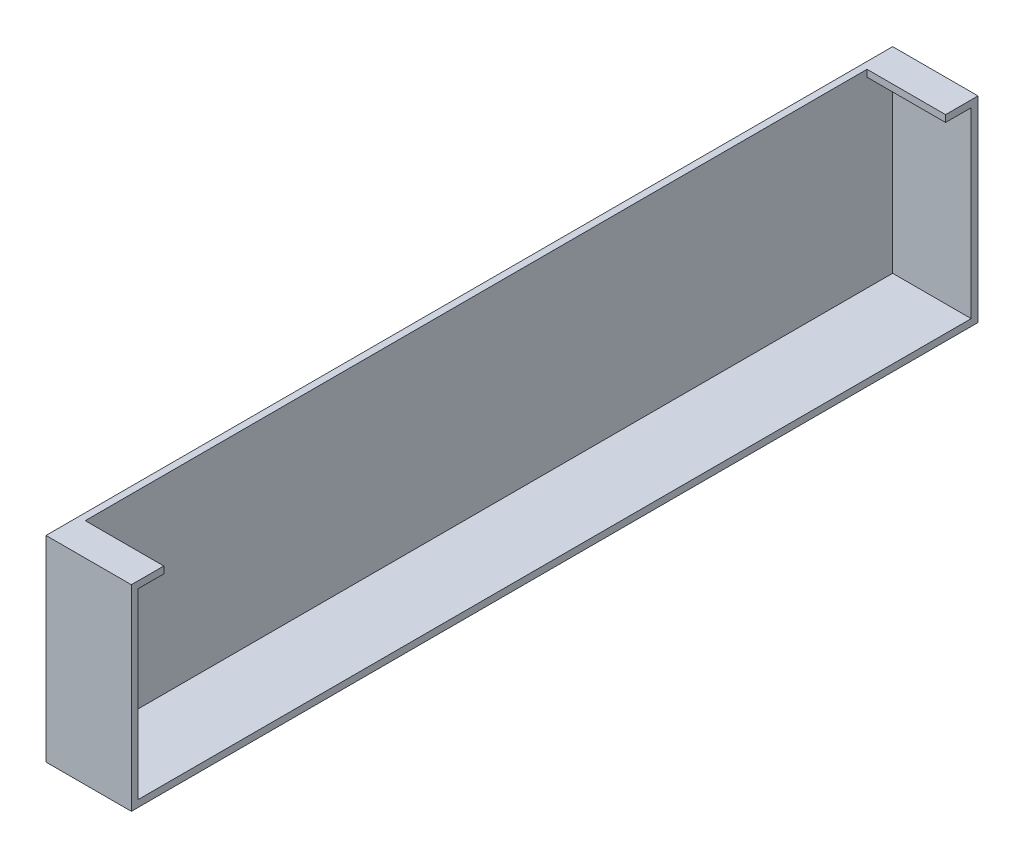
ISO-10303-21;
HEADER;
FILE_DESCRIPTION(('STEP AP214'),'2;1');
FILE_NAME('part.step','',(''),(''),'','','');
FILE_SCHEMA(('AUTOMOTIVE_DESIGN { 1 0 10303 214 1 1 1 1 }'));
ENDSEC;
DATA;
#1=APPLICATION_CONTEXT('core data for automotive mechanical design processes');
#2=APPLICATION_PROTOCOL_DEFINITION('international standard','automotive_design',2000,#1);
#3=PRODUCT_CONTEXT('',#1,'mechanical');
#4=PRODUCT('Part','Part','',(#3));
#5=PRODUCT_RELATED_PRODUCT_CATEGORY('part','',(#4));
#6=PRODUCT_DEFINITION_FORMATION('','',#4);
#7=PRODUCT_DEFINITION_CONTEXT('part definition',#1,'design');
#8=PRODUCT_DEFINITION('design','',#6,#7);
#9=PRODUCT_DEFINITION_SHAPE('','',#8);
#10=(LENGTH_UNIT() NAMED_UNIT(*) SI_UNIT(.MILLI.,.METRE.));
#11=(NAMED_UNIT(*) PLANE_ANGLE_UNIT() SI_UNIT($,.RADIAN.));
#12=(NAMED_UNIT(*) SI_UNIT($,.STERADIAN.) SOLID_ANGLE_UNIT());
#13=UNCERTAINTY_MEASURE_WITH_UNIT(LENGTH_MEASURE(1.E-05),#10,'distance_accuracy_value','');
#14=(GEOMETRIC_REPRESENTATION_CONTEXT(3) GLOBAL_UNCERTAINTY_ASSIGNED_CONTEXT((#13)) GLOBAL_UNIT_ASSIGNED_CONTEXT((#10,
#11,#12)) REPRESENTATION_CONTEXT('',''));
#15=CARTESIAN_POINT('',(0.,0.,0.));
#16=DIRECTION('',(0.,0.,1.));
#17=DIRECTION('',(1.,0.,0.));
#18=AXIS2_PLACEMENT_3D('',#15,#16,#17);
#19=CARTESIAN_POINT('',(4.,4.,-248.));
#20=DIRECTION('',(1.,0.,0.));
#21=DIRECTION('',(0.,0.,-1.));
#22=AXIS2_PLACEMENT_3D('',#19,#20,#21);
#23=PLANE('',#22);
#24=DIRECTION('',(0.,0.,1.));
#25=VECTOR('',#24,1.);
#26=CARTESIAN_POINT('',(4.,111.,0.));
#27=LINE('',#26,#25);
#28=CARTESIAN_POINT('',(4.,111.,-244.));
#29=VERTEX_POINT('',#28);
#30=CARTESIAN_POINT('',(4.,111.,-229.));
#31=VERTEX_POINT('',#30);
#32=EDGE_CURVE('E51',#29,#31,#27,.T.);
#33=ORIENTED_EDGE('',*,*,#32,.T.);
#34=DIRECTION('',(0.,1.,0.));
#35=VECTOR('',#34,1.);
#36=CARTESIAN_POINT('',(4.,111.,-229.));
#37=LINE('',#36,#35);
#38=CARTESIAN_POINT('',(4.,115.,-229.));
#39=VERTEX_POINT('',#38);
#40=EDGE_CURVE('E56',#31,#39,#37,.T.);
#41=ORIENTED_EDGE('',*,*,#40,.T.);
#42=DIRECTION('',(0.,0.,1.));
#43=VECTOR('',#42,1.);
#44=CARTESIAN_POINT('',(4.,115.,-248.));
#45=LINE('',#44,#43);
#46=CARTESIAN_POINT('',(4.,115.,229.));
#47=VERTEX_POINT('',#46);
#48=EDGE_CURVE('E208',#39,#47,#45,.T.);
#49=ORIENTED_EDGE('',*,*,#48,.T.);
#50=DIRECTION('',(0.,1.,0.));
#51=VECTOR('',#50,1.);
#52=CARTESIAN_POINT('',(4.,111.,229.));
#53=LINE('',#52,#51);
#54=CARTESIAN_POINT('',(4.,111.,229.));
#55=VERTEX_POINT('',#54);
#56=EDGE_CURVE('E162',#55,#47,#53,.T.);
#57=ORIENTED_EDGE('',*,*,#56,.F.);
#58=DIRECTION('',(0.,0.,-1.));
#59=VECTOR('',#58,1.);
#60=CARTESIAN_POINT('',(4.,111.,0.));
#61=LINE('',#60,#59);
#62=CARTESIAN_POINT('',(4.,111.,244.));
#63=VERTEX_POINT('',#62);
#64=EDGE_CURVE('E157',#63,#55,#61,.T.);
#65=ORIENTED_EDGE('',*,*,#64,.F.);
#66=DIRECTION('',(0.,-1.,0.));
#67=VECTOR('',#66,1.);
#68=CARTESIAN_POINT('',(4.,4.,244.));
#69=LINE('',#68,#67);
#70=CARTESIAN_POINT('',(4.,4.,244.));
#71=VERTEX_POINT('',#70);
#72=EDGE_CURVE('E183',#63,#71,#69,.T.);
#73=ORIENTED_EDGE('',*,*,#72,.T.);
#74=DIRECTION('',(0.,0.,1.));
#75=VECTOR('',#74,1.);
#76=CARTESIAN_POINT('',(4.,4.,-248.));
#77=LINE('',#76,#75);
#78=CARTESIAN_POINT('',(4.,4.,-244.));
#79=VERTEX_POINT('',#78);
#80=EDGE_CURVE('E210',#79,#71,#77,.T.);
#81=ORIENTED_EDGE('',*,*,#80,.F.);
#82=DIRECTION('',(0.,1.,0.));
#83=VECTOR('',#82,1.);
#84=CARTESIAN_POINT('',(4.,4.,-244.));
#85=LINE('',#84,#83);
#86=EDGE_CURVE('E172',#79,#29,#85,.T.);
#87=ORIENTED_EDGE('',*,*,#86,.T.);
#88=EDGE_LOOP('',(#33,#41,#49,#57,#65,#73,#81,#87));
#89=FACE_BOUND('',#88,.T.);
#90=ADVANCED_FACE('F34',(#89),#23,.T.);
#91=CARTESIAN_POINT('',(0.,0.,-244.));
#92=DIRECTION('',(0.,0.,-1.));
#93=DIRECTION('',(1.,0.,0.));
#94=AXIS2_PLACEMENT_3D('',#91,#92,#93);
#95=PLANE('',#94);
#96=DIRECTION('',(-1.,0.,0.));
#97=VECTOR('',#96,1.);
#98=CARTESIAN_POINT('',(0.,111.,-244.));
#99=LINE('',#98,#97);
#100=CARTESIAN_POINT('',(50.,111.,-244.));
#101=VERTEX_POINT('',#100);
#102=EDGE_CURVE('E135',#101,#29,#99,.T.);
#103=ORIENTED_EDGE('',*,*,#102,.T.);
#104=ORIENTED_EDGE('',*,*,#86,.F.);
#105=DIRECTION('',(-1.,0.,0.));
#106=VECTOR('',#105,1.);
#107=CARTESIAN_POINT('',(4.,4.,-244.));
#108=LINE('',#107,#106);
#109=CARTESIAN_POINT('',(50.,4.,-244.));
#110=VERTEX_POINT('',#109);
#111=EDGE_CURVE('E170',#110,#79,#108,.T.);
#112=ORIENTED_EDGE('',*,*,#111,.F.);
#113=DIRECTION('',(0.,1.,0.));
#114=VECTOR('',#113,1.);
#115=CARTESIAN_POINT('',(50.,115.,-244.));
#116=LINE('',#115,#114);
#117=EDGE_CURVE('E165',#110,#101,#116,.T.);
#118=ORIENTED_EDGE('',*,*,#117,.T.);
#119=EDGE_LOOP('',(#103,#104,#112,#118));
#120=FACE_BOUND('',#119,.T.);
#121=ADVANCED_FACE('F250',(#120),#95,.F.);
#122=CARTESIAN_POINT('',(0.,0.,244.));
#123=DIRECTION('',(0.,0.,1.));
#124=DIRECTION('',(1.,0.,0.));
#125=AXIS2_PLACEMENT_3D('',#122,#123,#124);
#126=PLANE('',#125);
#127=DIRECTION('',(-1.,0.,0.));
#128=VECTOR('',#127,1.);
#129=CARTESIAN_POINT('',(0.,111.,244.));
#130=LINE('',#129,#128);
#131=CARTESIAN_POINT('',(50.,111.,244.));
#132=VERTEX_POINT('',#131);
#133=EDGE_CURVE('E159',#132,#63,#130,.T.);
#134=ORIENTED_EDGE('',*,*,#133,.F.);
#135=DIRECTION('',(0.,1.,0.));
#136=VECTOR('',#135,1.);
#137=CARTESIAN_POINT('',(50.,115.,244.));
#138=LINE('',#137,#136);
#139=CARTESIAN_POINT('',(50.,4.,244.));
#140=VERTEX_POINT('',#139);
#141=EDGE_CURVE('E174',#140,#132,#138,.T.);
#142=ORIENTED_EDGE('',*,*,#141,.F.);
#143=DIRECTION('',(1.,0.,0.));
#144=VECTOR('',#143,1.);
#145=CARTESIAN_POINT('',(4.,4.,244.));
#146=LINE('',#145,#144);
#147=EDGE_CURVE('E180',#71,#140,#146,.T.);
#148=ORIENTED_EDGE('',*,*,#147,.F.);
#149=ORIENTED_EDGE('',*,*,#72,.F.);
#150=EDGE_LOOP('',(#134,#142,#148,#149));
#151=FACE_BOUND('',#150,.T.);
#152=ADVANCED_FACE('F242',(#151),#126,.F.);
#153=CARTESIAN_POINT('',(4.,4.,-248.));
#154=DIRECTION('',(0.,1.,0.));
#155=DIRECTION('',(0.,0.,1.));
#156=AXIS2_PLACEMENT_3D('',#153,#154,#155);
#157=PLANE('',#156);
#158=DIRECTION('',(0.,0.,1.));
#159=VECTOR('',#158,1.);
#160=CARTESIAN_POINT('',(50.,4.,-248.));
#161=LINE('',#160,#159);
#162=EDGE_CURVE('E212',#110,#140,#161,.T.);
#163=ORIENTED_EDGE('',*,*,#162,.F.);
#164=ORIENTED_EDGE('',*,*,#111,.T.);
#165=ORIENTED_EDGE('',*,*,#80,.T.);
#166=ORIENTED_EDGE('',*,*,#147,.T.);
#167=EDGE_LOOP('',(#163,#164,#165,#166));
#168=FACE_BOUND('',#167,.T.);
#169=ADVANCED_FACE('F245',(#168),#157,.T.);
#170=CARTESIAN_POINT('',(0.,0.,-248.));
#171=DIRECTION('',(0.,-1.,0.));
#172=DIRECTION('',(0.,0.,-1.));
#173=AXIS2_PLACEMENT_3D('',#170,#171,#172);
#174=PLANE('',#173);
#175=DIRECTION('',(0.,0.,1.));
#176=VECTOR('',#175,1.);
#177=CARTESIAN_POINT('',(50.,0.,-248.));
#178=LINE('',#177,#176);
#179=CARTESIAN_POINT('',(50.,0.,-248.));
#180=VERTEX_POINT('',#179);
#181=CARTESIAN_POINT('',(50.,0.,248.));
#182=VERTEX_POINT('',#181);
#183=EDGE_CURVE('E38',#180,#182,#178,.T.);
#184=ORIENTED_EDGE('',*,*,#183,.T.);
#185=DIRECTION('',(1.,0.,0.));
#186=VECTOR('',#185,1.);
#187=CARTESIAN_POINT('',(0.,0.,248.));
#188=LINE('',#187,#186);
#189=CARTESIAN_POINT('',(0.,0.,248.));
#190=VERTEX_POINT('',#189);
#191=EDGE_CURVE('E185',#190,#182,#188,.T.);
#192=ORIENTED_EDGE('',*,*,#191,.F.);
#193=DIRECTION('',(0.,0.,1.));
#194=VECTOR('',#193,1.);
#195=CARTESIAN_POINT('',(0.,0.,-248.));
#196=LINE('',#195,#194);
#197=CARTESIAN_POINT('',(0.,0.,-248.));
#198=VERTEX_POINT('',#197);
#199=EDGE_CURVE('E11',#198,#190,#196,.T.);
#200=ORIENTED_EDGE('',*,*,#199,.F.);
#201=DIRECTION('',(1.,0.,0.));
#202=VECTOR('',#201,1.);
#203=CARTESIAN_POINT('',(0.,0.,-248.));
#204=LINE('',#203,#202);
#205=EDGE_CURVE('E196',#198,#180,#204,.T.);
#206=ORIENTED_EDGE('',*,*,#205,.T.);
#207=EDGE_LOOP('',(#184,#192,#200,#206));
#208=FACE_BOUND('',#207,.T.);
#209=ADVANCED_FACE('F36',(#208),#174,.T.);
#210=CARTESIAN_POINT('',(0.,0.,-248.));
#211=DIRECTION('',(-1.,0.,0.));
#212=DIRECTION('',(0.,0.,1.));
#213=AXIS2_PLACEMENT_3D('',#210,#211,#212);
#214=PLANE('',#213);
#215=ORIENTED_EDGE('',*,*,#199,.T.);
#216=DIRECTION('',(0.,-1.,0.));
#217=VECTOR('',#216,1.);
#218=CARTESIAN_POINT('',(0.,0.,248.));
#219=LINE('',#218,#217);
#220=CARTESIAN_POINT('',(0.,115.,248.));
#221=VERTEX_POINT('',#220);
#222=EDGE_CURVE('E193',#221,#190,#219,.T.);
#223=ORIENTED_EDGE('',*,*,#222,.F.);
#224=DIRECTION('',(0.,0.,1.));
#225=VECTOR('',#224,1.);
#226=CARTESIAN_POINT('',(0.,115.,-248.));
#227=LINE('',#226,#225);
#228=CARTESIAN_POINT('',(0.,115.,-248.));
#229=VERTEX_POINT('',#228);
#230=EDGE_CURVE('E43',#229,#221,#227,.T.);
#231=ORIENTED_EDGE('',*,*,#230,.F.);
#232=DIRECTION('',(0.,-1.,0.));
#233=VECTOR('',#232,1.);
#234=CARTESIAN_POINT('',(0.,0.,-248.));
#235=LINE('',#234,#233);
#236=EDGE_CURVE('E204',#229,#198,#235,.T.);
#237=ORIENTED_EDGE('',*,*,#236,.T.);
#238=EDGE_LOOP('',(#215,#223,#231,#237));
#239=FACE_BOUND('',#238,.T.);
#240=ADVANCED_FACE('F224',(#239),#214,.T.);
#241=CARTESIAN_POINT('',(0.,115.,-248.));
#242=DIRECTION('',(0.,1.,0.));
#243=DIRECTION('',(0.,0.,1.));
#244=AXIS2_PLACEMENT_3D('',#241,#242,#243);
#245=PLANE('',#244);
#246=ORIENTED_EDGE('',*,*,#48,.F.);
#247=DIRECTION('',(-1.,0.,0.));
#248=VECTOR('',#247,1.);
#249=CARTESIAN_POINT('',(0.,115.,-229.));
#250=LINE('',#249,#248);
#251=CARTESIAN_POINT('',(50.,115.,-229.));
#252=VERTEX_POINT('',#251);
#253=EDGE_CURVE('E138',#252,#39,#250,.T.);
#254=ORIENTED_EDGE('',*,*,#253,.F.);
#255=DIRECTION('',(0.,0.,-1.));
#256=VECTOR('',#255,1.);
#257=CARTESIAN_POINT('',(50.,115.,-244.));
#258=LINE('',#257,#256);
#259=CARTESIAN_POINT('',(50.,115.,-248.));
#260=VERTEX_POINT('',#259);
#261=EDGE_CURVE('E142',#252,#260,#258,.T.);
#262=ORIENTED_EDGE('',*,*,#261,.T.);
#263=DIRECTION('',(-1.,0.,0.));
#264=VECTOR('',#263,1.);
#265=CARTESIAN_POINT('',(0.,115.,-248.));
#266=LINE('',#265,#264);
#267=EDGE_CURVE('E201',#260,#229,#266,.T.);
#268=ORIENTED_EDGE('',*,*,#267,.T.);
#269=ORIENTED_EDGE('',*,*,#230,.T.);
#270=DIRECTION('',(-1.,0.,0.));
#271=VECTOR('',#270,1.);
#272=CARTESIAN_POINT('',(0.,115.,248.));
#273=LINE('',#272,#271);
#274=CARTESIAN_POINT('',(50.,115.,248.));
#275=VERTEX_POINT('',#274);
#276=EDGE_CURVE('E190',#275,#221,#273,.T.);
#277=ORIENTED_EDGE('',*,*,#276,.F.);
#278=DIRECTION('',(0.,0.,1.));
#279=VECTOR('',#278,1.);
#280=CARTESIAN_POINT('',(50.,115.,244.));
#281=LINE('',#280,#279);
#282=CARTESIAN_POINT('',(50.,115.,229.));
#283=VERTEX_POINT('',#282);
#284=EDGE_CURVE('E177',#283,#275,#281,.T.);
#285=ORIENTED_EDGE('',*,*,#284,.F.);
#286=DIRECTION('',(-1.,0.,0.));
#287=VECTOR('',#286,1.);
#288=CARTESIAN_POINT('',(0.,115.,229.));
#289=LINE('',#288,#287);
#290=EDGE_CURVE('E144',#283,#47,#289,.T.);
#291=ORIENTED_EDGE('',*,*,#290,.T.);
#292=EDGE_LOOP('',(#246,#254,#262,#268,#269,#277,#285,#291));
#293=FACE_BOUND('',#292,.T.);
#294=ADVANCED_FACE('F230',(#293),#245,.T.);
#295=CARTESIAN_POINT('',(50.,4.,-248.));
#296=DIRECTION('',(1.,0.,0.));
#297=DIRECTION('',(0.,0.,-1.));
#298=AXIS2_PLACEMENT_3D('',#295,#296,#297);
#299=PLANE('',#298);
#300=DIRECTION('',(0.,1.,0.));
#301=VECTOR('',#300,1.);
#302=CARTESIAN_POINT('',(50.,4.,-248.));
#303=LINE('',#302,#301);
#304=EDGE_CURVE('E199',#180,#260,#303,.T.);
#305=ORIENTED_EDGE('',*,*,#304,.T.);
#306=ORIENTED_EDGE('',*,*,#261,.F.);
#307=DIRECTION('',(0.,1.,0.));
#308=VECTOR('',#307,1.);
#309=CARTESIAN_POINT('',(50.,111.,-229.));
#310=LINE('',#309,#308);
#311=CARTESIAN_POINT('',(50.,111.,-229.));
#312=VERTEX_POINT('',#311);
#313=EDGE_CURVE('E128',#312,#252,#310,.T.);
#314=ORIENTED_EDGE('',*,*,#313,.F.);
#315=DIRECTION('',(0.,0.,1.));
#316=VECTOR('',#315,1.);
#317=CARTESIAN_POINT('',(50.,111.,0.));
#318=LINE('',#317,#316);
#319=EDGE_CURVE('E133',#101,#312,#318,.T.);
#320=ORIENTED_EDGE('',*,*,#319,.F.);
#321=ORIENTED_EDGE('',*,*,#117,.F.);
#322=ORIENTED_EDGE('',*,*,#162,.T.);
#323=ORIENTED_EDGE('',*,*,#141,.T.);
#324=DIRECTION('',(0.,0.,-1.));
#325=VECTOR('',#324,1.);
#326=CARTESIAN_POINT('',(50.,111.,0.));
#327=LINE('',#326,#325);
#328=CARTESIAN_POINT('',(50.,111.,229.));
#329=VERTEX_POINT('',#328);
#330=EDGE_CURVE('E147',#132,#329,#327,.T.);
#331=ORIENTED_EDGE('',*,*,#330,.T.);
#332=DIRECTION('',(0.,1.,0.));
#333=VECTOR('',#332,1.);
#334=CARTESIAN_POINT('',(50.,111.,229.));
#335=LINE('',#334,#333);
#336=EDGE_CURVE('E160',#329,#283,#335,.T.);
#337=ORIENTED_EDGE('',*,*,#336,.T.);
#338=ORIENTED_EDGE('',*,*,#284,.T.);
#339=DIRECTION('',(0.,1.,0.));
#340=VECTOR('',#339,1.);
#341=CARTESIAN_POINT('',(50.,4.,248.));
#342=LINE('',#341,#340);
#343=EDGE_CURVE('E188',#182,#275,#342,.T.);
#344=ORIENTED_EDGE('',*,*,#343,.F.);
#345=ORIENTED_EDGE('',*,*,#183,.F.);
#346=EDGE_LOOP('',(#305,#306,#314,#320,#321,#322,#323,#331,#337,#338,#344,#345));
#347=FACE_BOUND('',#346,.T.);
#348=ADVANCED_FACE('F140',(#347),#299,.T.);
#349=CARTESIAN_POINT('',(0.,0.,-248.));
#350=DIRECTION('',(0.,0.,-1.));
#351=DIRECTION('',(-1.,0.,0.));
#352=AXIS2_PLACEMENT_3D('',#349,#350,#351);
#353=PLANE('',#352);
#354=ORIENTED_EDGE('',*,*,#267,.F.);
#355=ORIENTED_EDGE('',*,*,#304,.F.);
#356=ORIENTED_EDGE('',*,*,#205,.F.);
#357=ORIENTED_EDGE('',*,*,#236,.F.);
#358=EDGE_LOOP('',(#354,#355,#356,#357));
#359=FACE_BOUND('',#358,.T.);
#360=ADVANCED_FACE('F228',(#359),#353,.T.);
#361=CARTESIAN_POINT('',(0.,0.,248.));
#362=DIRECTION('',(0.,0.,-1.));
#363=DIRECTION('',(-1.,0.,0.));
#364=AXIS2_PLACEMENT_3D('',#361,#362,#363);
#365=PLANE('',#364);
#366=ORIENTED_EDGE('',*,*,#343,.T.);
#367=ORIENTED_EDGE('',*,*,#276,.T.);
#368=ORIENTED_EDGE('',*,*,#222,.T.);
#369=ORIENTED_EDGE('',*,*,#191,.T.);
#370=EDGE_LOOP('',(#366,#367,#368,#369));
#371=FACE_BOUND('',#370,.T.);
#372=ADVANCED_FACE('F221',(#371),#365,.F.);
#373=CARTESIAN_POINT('',(0.,111.,229.));
#374=DIRECTION('',(0.,0.,-1.));
#375=DIRECTION('',(-1.,0.,0.));
#376=AXIS2_PLACEMENT_3D('',#373,#374,#375);
#377=PLANE('',#376);
#378=ORIENTED_EDGE('',*,*,#290,.F.);
#379=ORIENTED_EDGE('',*,*,#336,.F.);
#380=DIRECTION('',(-1.,0.,0.));
#381=VECTOR('',#380,1.);
#382=CARTESIAN_POINT('',(0.,111.,229.));
#383=LINE('',#382,#381);
#384=EDGE_CURVE('E154',#329,#55,#383,.T.);
#385=ORIENTED_EDGE('',*,*,#384,.T.);
#386=ORIENTED_EDGE('',*,*,#56,.T.);
#387=EDGE_LOOP('',(#378,#379,#385,#386));
#388=FACE_BOUND('',#387,.T.);
#389=ADVANCED_FACE('F235',(#388),#377,.T.);
#390=CARTESIAN_POINT('',(0.,111.,0.));
#391=DIRECTION('',(0.,1.,0.));
#392=DIRECTION('',(0.,0.,1.));
#393=AXIS2_PLACEMENT_3D('',#390,#391,#392);
#394=PLANE('',#393);
#395=ORIENTED_EDGE('',*,*,#330,.F.);
#396=ORIENTED_EDGE('',*,*,#133,.T.);
#397=ORIENTED_EDGE('',*,*,#64,.T.);
#398=ORIENTED_EDGE('',*,*,#384,.F.);
#399=EDGE_LOOP('',(#395,#396,#397,#398));
#400=FACE_BOUND('',#399,.T.);
#401=ADVANCED_FACE('F238',(#400),#394,.F.);
#402=CARTESIAN_POINT('',(0.,111.,-229.));
#403=DIRECTION('',(0.,0.,-1.));
#404=DIRECTION('',(-1.,0.,0.));
#405=AXIS2_PLACEMENT_3D('',#402,#403,#404);
#406=PLANE('',#405);
#407=ORIENTED_EDGE('',*,*,#253,.T.);
#408=ORIENTED_EDGE('',*,*,#40,.F.);
#409=DIRECTION('',(-1.,0.,0.));
#410=VECTOR('',#409,1.);
#411=CARTESIAN_POINT('',(0.,111.,-229.));
#412=LINE('',#411,#410);
#413=EDGE_CURVE('E123',#312,#31,#412,.T.);
#414=ORIENTED_EDGE('',*,*,#413,.F.);
#415=ORIENTED_EDGE('',*,*,#313,.T.);
#416=EDGE_LOOP('',(#407,#408,#414,#415));
#417=FACE_BOUND('',#416,.T.);
#418=ADVANCED_FACE('F126',(#417),#406,.F.);
#419=CARTESIAN_POINT('',(0.,111.,0.));
#420=DIRECTION('',(0.,1.,0.));
#421=DIRECTION('',(0.,0.,-1.));
#422=AXIS2_PLACEMENT_3D('',#419,#420,#421);
#423=PLANE('',#422);
#424=ORIENTED_EDGE('',*,*,#319,.T.);
#425=ORIENTED_EDGE('',*,*,#413,.T.);
#426=ORIENTED_EDGE('',*,*,#32,.F.);
#427=ORIENTED_EDGE('',*,*,#102,.F.);
#428=EDGE_LOOP('',(#424,#425,#426,#427));
#429=FACE_BOUND('',#428,.T.);
#430=ADVANCED_FACE('F134',(#429),#423,.F.);
#431=CLOSED_SHELL('',(#90,#121,#152,#169,#209,#240,#294,#348,#360,#372,#389,#401,#418,#430));
#432=MANIFOLD_SOLID_BREP('B2',#431);
#433=ADVANCED_BREP_SHAPE_REPRESENTATION('',(#18,#432),#14);
#434=SHAPE_DEFINITION_REPRESENTATION(#9,#433);
ENDSEC;
END-ISO-10303-21;
